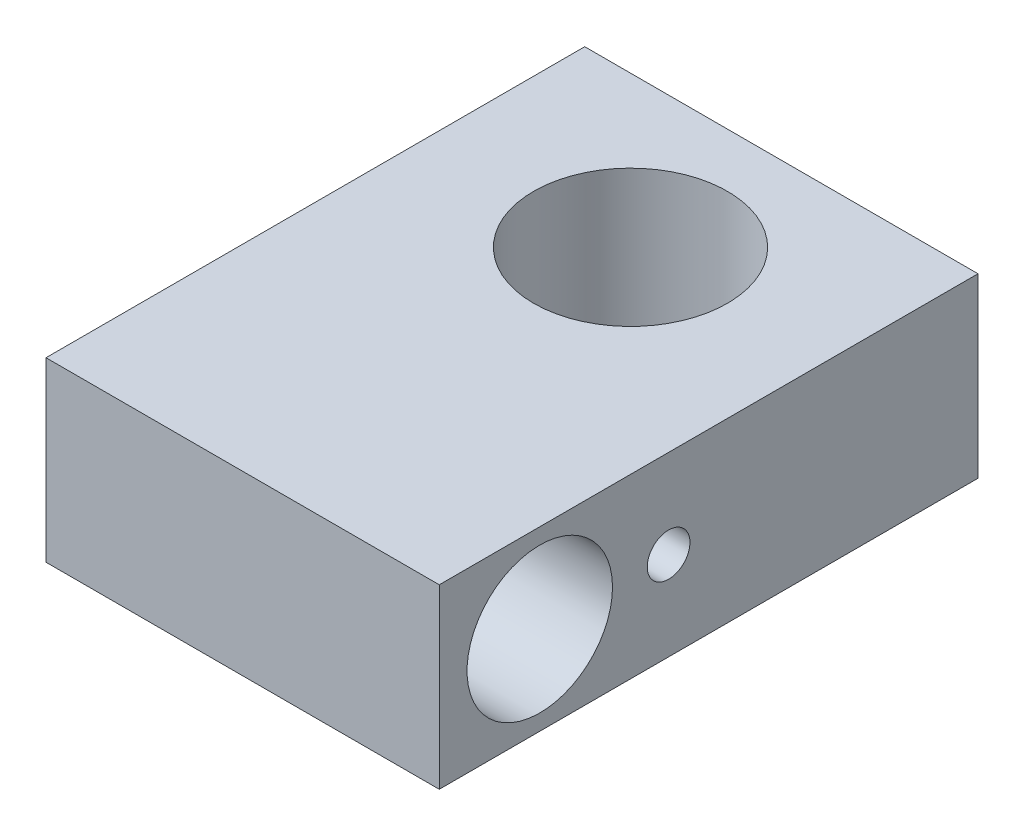
ISO-10303-21;
HEADER;
FILE_DESCRIPTION(('STEP AP214'),'2;1');
FILE_NAME('part.step','',(''),(''),'','','');
FILE_SCHEMA(('AUTOMOTIVE_DESIGN { 1 0 10303 214 1 1 1 1 }'));
ENDSEC;
DATA;
#1=APPLICATION_CONTEXT('core data for automotive mechanical design processes');
#2=APPLICATION_PROTOCOL_DEFINITION('international standard','automotive_design',2000,#1);
#3=PRODUCT_CONTEXT('',#1,'mechanical');
#4=PRODUCT('Part','Part','',(#3));
#5=PRODUCT_RELATED_PRODUCT_CATEGORY('part','',(#4));
#6=PRODUCT_DEFINITION_FORMATION('','',#4);
#7=PRODUCT_DEFINITION_CONTEXT('part definition',#1,'design');
#8=PRODUCT_DEFINITION('design','',#6,#7);
#9=PRODUCT_DEFINITION_SHAPE('','',#8);
#10=(LENGTH_UNIT() NAMED_UNIT(*) SI_UNIT(.MILLI.,.METRE.));
#11=(NAMED_UNIT(*) PLANE_ANGLE_UNIT() SI_UNIT($,.RADIAN.));
#12=(NAMED_UNIT(*) SI_UNIT($,.STERADIAN.) SOLID_ANGLE_UNIT());
#13=UNCERTAINTY_MEASURE_WITH_UNIT(LENGTH_MEASURE(1.E-05),#10,'distance_accuracy_value','');
#14=(GEOMETRIC_REPRESENTATION_CONTEXT(3) GLOBAL_UNCERTAINTY_ASSIGNED_CONTEXT((#13)) GLOBAL_UNIT_ASSIGNED_CONTEXT((#10,
#11,#12)) REPRESENTATION_CONTEXT('',''));
#15=CARTESIAN_POINT('',(0.,0.,0.));
#16=DIRECTION('',(0.,0.,1.));
#17=DIRECTION('',(1.,0.,0.));
#18=AXIS2_PLACEMENT_3D('',#15,#16,#17);
#19=CARTESIAN_POINT('',(-9.125,8.22,-7.));
#20=DIRECTION('',(0.,0.,1.));
#21=DIRECTION('',(1.,0.,0.));
#22=AXIS2_PLACEMENT_3D('',#19,#20,#21);
#23=PLANE('',#22);
#24=DIRECTION('',(-1.,0.,0.));
#25=VECTOR('',#24,1.);
#26=CARTESIAN_POINT('',(-9.125,0.,-7.));
#27=LINE('',#26,#25);
#28=CARTESIAN_POINT('',(9.125,0.,-6.99999999999999));
#29=VERTEX_POINT('',#28);
#30=CARTESIAN_POINT('',(-9.125,0.,-7.));
#31=VERTEX_POINT('',#30);
#32=EDGE_CURVE('E98',#29,#31,#27,.T.);
#33=ORIENTED_EDGE('',*,*,#32,.T.);
#34=DIRECTION('',(0.,-1.,0.));
#35=VECTOR('',#34,1.);
#36=CARTESIAN_POINT('',(-9.125,8.22,-7.));
#37=LINE('',#36,#35);
#38=CARTESIAN_POINT('',(-9.125,8.22,-7.));
#39=VERTEX_POINT('',#38);
#40=EDGE_CURVE('E11',#39,#31,#37,.T.);
#41=ORIENTED_EDGE('',*,*,#40,.F.);
#42=DIRECTION('',(-1.,0.,0.));
#43=VECTOR('',#42,1.);
#44=CARTESIAN_POINT('',(-9.125,8.22,-7.));
#45=LINE('',#44,#43);
#46=CARTESIAN_POINT('',(9.125,8.22,-6.99999999999999));
#47=VERTEX_POINT('',#46);
#48=EDGE_CURVE('E86',#47,#39,#45,.T.);
#49=ORIENTED_EDGE('',*,*,#48,.F.);
#50=DIRECTION('',(0.,-1.,0.));
#51=VECTOR('',#50,1.);
#52=CARTESIAN_POINT('',(9.125,8.22,-6.99999999999999));
#53=LINE('',#52,#51);
#54=EDGE_CURVE('E94',#47,#29,#53,.T.);
#55=ORIENTED_EDGE('',*,*,#54,.T.);
#56=EDGE_LOOP('',(#33,#41,#49,#55));
#57=FACE_BOUND('',#56,.T.);
#58=ADVANCED_FACE('F35',(#57),#23,.F.);
#59=CARTESIAN_POINT('',(-9.125,8.22,18.));
#60=DIRECTION('',(1.,0.,0.));
#61=DIRECTION('',(0.,0.,-1.));
#62=AXIS2_PLACEMENT_3D('',#59,#60,#61);
#63=PLANE('',#62);
#64=CARTESIAN_POINT('',(-9.125,4.11,7.3575));
#65=DIRECTION('',(1.,0.,0.));
#66=DIRECTION('',(0.,0.,-1.));
#67=AXIS2_PLACEMENT_3D('',#64,#65,#66);
#68=CIRCLE('',#67,0.990599999999999);
#69=CARTESIAN_POINT('',(-9.125,4.11,6.3669));
#70=VERTEX_POINT('',#69);
#71=EDGE_CURVE('E121',#70,#70,#68,.T.);
#72=ORIENTED_EDGE('',*,*,#71,.T.);
#73=EDGE_LOOP('',(#72));
#74=FACE_BOUND('',#73,.T.);
#75=CARTESIAN_POINT('',(-9.125,4.11,13.336186812336));
#76=DIRECTION('',(1.,0.,0.));
#77=DIRECTION('',(0.,0.,-1.));
#78=AXIS2_PLACEMENT_3D('',#75,#76,#77);
#79=CIRCLE('',#78,3.375);
#80=CARTESIAN_POINT('',(-9.125,4.11,9.96118681233597));
#81=VERTEX_POINT('',#80);
#82=EDGE_CURVE('E117',#81,#81,#79,.T.);
#83=ORIENTED_EDGE('',*,*,#82,.T.);
#84=EDGE_LOOP('',(#83));
#85=FACE_BOUND('',#84,.T.);
#86=DIRECTION('',(0.,0.,1.));
#87=VECTOR('',#86,1.);
#88=CARTESIAN_POINT('',(-9.125,0.,18.));
#89=LINE('',#88,#87);
#90=CARTESIAN_POINT('',(-9.125,0.,18.));
#91=VERTEX_POINT('',#90);
#92=EDGE_CURVE('E90',#31,#91,#89,.T.);
#93=ORIENTED_EDGE('',*,*,#92,.T.);
#94=DIRECTION('',(0.,-1.,0.));
#95=VECTOR('',#94,1.);
#96=CARTESIAN_POINT('',(-9.125,8.22,18.));
#97=LINE('',#96,#95);
#98=CARTESIAN_POINT('',(-9.125,8.22,18.));
#99=VERTEX_POINT('',#98);
#100=EDGE_CURVE('E43',#99,#91,#97,.T.);
#101=ORIENTED_EDGE('',*,*,#100,.F.);
#102=DIRECTION('',(0.,0.,1.));
#103=VECTOR('',#102,1.);
#104=CARTESIAN_POINT('',(-9.125,8.22,18.));
#105=LINE('',#104,#103);
#106=EDGE_CURVE('E81',#39,#99,#105,.T.);
#107=ORIENTED_EDGE('',*,*,#106,.F.);
#108=ORIENTED_EDGE('',*,*,#40,.T.);
#109=EDGE_LOOP('',(#93,#101,#107,#108));
#110=FACE_BOUND('',#109,.T.);
#111=ADVANCED_FACE('F89',(#74,#85,#110),#63,.F.);
#112=CARTESIAN_POINT('',(9.125,8.22,18.));
#113=DIRECTION('',(0.,0.,-1.));
#114=DIRECTION('',(-1.,0.,0.));
#115=AXIS2_PLACEMENT_3D('',#112,#113,#114);
#116=PLANE('',#115);
#117=DIRECTION('',(1.,0.,0.));
#118=VECTOR('',#117,1.);
#119=CARTESIAN_POINT('',(9.125,0.,18.));
#120=LINE('',#119,#118);
#121=CARTESIAN_POINT('',(9.125,0.,18.));
#122=VERTEX_POINT('',#121);
#123=EDGE_CURVE('E68',#91,#122,#120,.T.);
#124=ORIENTED_EDGE('',*,*,#123,.T.);
#125=DIRECTION('',(0.,-1.,0.));
#126=VECTOR('',#125,1.);
#127=CARTESIAN_POINT('',(9.125,8.22,18.));
#128=LINE('',#127,#126);
#129=CARTESIAN_POINT('',(9.125,8.22,18.));
#130=VERTEX_POINT('',#129);
#131=EDGE_CURVE('E91',#130,#122,#128,.T.);
#132=ORIENTED_EDGE('',*,*,#131,.F.);
#133=DIRECTION('',(1.,0.,0.));
#134=VECTOR('',#133,1.);
#135=CARTESIAN_POINT('',(9.125,8.22,18.));
#136=LINE('',#135,#134);
#137=EDGE_CURVE('E84',#99,#130,#136,.T.);
#138=ORIENTED_EDGE('',*,*,#137,.F.);
#139=ORIENTED_EDGE('',*,*,#100,.T.);
#140=EDGE_LOOP('',(#124,#132,#138,#139));
#141=FACE_BOUND('',#140,.T.);
#142=ADVANCED_FACE('F92',(#141),#116,.F.);
#143=CARTESIAN_POINT('',(9.125,8.22,-6.99999999999999));
#144=DIRECTION('',(-1.,0.,0.));
#145=DIRECTION('',(0.,0.,1.));
#146=AXIS2_PLACEMENT_3D('',#143,#144,#145);
#147=PLANE('',#146);
#148=CARTESIAN_POINT('',(9.125,4.11,7.3575));
#149=DIRECTION('',(1.,0.,0.));
#150=DIRECTION('',(0.,0.,-1.));
#151=AXIS2_PLACEMENT_3D('',#148,#149,#150);
#152=CIRCLE('',#151,0.990599999999999);
#153=CARTESIAN_POINT('',(9.125,4.11,6.3669));
#154=VERTEX_POINT('',#153);
#155=EDGE_CURVE('E124',#154,#154,#152,.T.);
#156=ORIENTED_EDGE('',*,*,#155,.F.);
#157=EDGE_LOOP('',(#156));
#158=FACE_BOUND('',#157,.T.);
#159=CARTESIAN_POINT('',(9.125,4.11,13.336186812336));
#160=DIRECTION('',(1.,0.,0.));
#161=DIRECTION('',(0.,0.,-1.));
#162=AXIS2_PLACEMENT_3D('',#159,#160,#161);
#163=CIRCLE('',#162,3.375);
#164=CARTESIAN_POINT('',(9.125,4.11,9.96118681233596));
#165=VERTEX_POINT('',#164);
#166=EDGE_CURVE('E118',#165,#165,#163,.T.);
#167=ORIENTED_EDGE('',*,*,#166,.F.);
#168=EDGE_LOOP('',(#167));
#169=FACE_BOUND('',#168,.T.);
#170=DIRECTION('',(0.,0.,-1.));
#171=VECTOR('',#170,1.);
#172=CARTESIAN_POINT('',(9.125,0.,-6.99999999999999));
#173=LINE('',#172,#171);
#174=EDGE_CURVE('E74',#122,#29,#173,.T.);
#175=ORIENTED_EDGE('',*,*,#174,.T.);
#176=ORIENTED_EDGE('',*,*,#54,.F.);
#177=DIRECTION('',(0.,0.,-1.));
#178=VECTOR('',#177,1.);
#179=CARTESIAN_POINT('',(9.125,8.22,-6.99999999999999));
#180=LINE('',#179,#178);
#181=EDGE_CURVE('E51',#130,#47,#180,.T.);
#182=ORIENTED_EDGE('',*,*,#181,.F.);
#183=ORIENTED_EDGE('',*,*,#131,.T.);
#184=EDGE_LOOP('',(#175,#176,#182,#183));
#185=FACE_BOUND('',#184,.T.);
#186=ADVANCED_FACE('F106',(#158,#169,#185),#147,.F.);
#187=CARTESIAN_POINT('',(9.125,8.22,-6.99999999999999));
#188=DIRECTION('',(0.,-1.,0.));
#189=DIRECTION('',(0.,0.,-1.));
#190=AXIS2_PLACEMENT_3D('',#187,#188,#189);
#191=PLANE('',#190);
#192=CARTESIAN_POINT('',(0.,8.22,0.));
#193=DIRECTION('',(0.,1.,0.));
#194=DIRECTION('',(0.,0.,1.));
#195=AXIS2_PLACEMENT_3D('',#192,#193,#194);
#196=CIRCLE('',#195,4.5);
#197=CARTESIAN_POINT('',(0.,8.22,4.5));
#198=VERTEX_POINT('',#197);
#199=EDGE_CURVE('E114',#198,#198,#196,.T.);
#200=ORIENTED_EDGE('',*,*,#199,.F.);
#201=EDGE_LOOP('',(#200));
#202=FACE_BOUND('',#201,.T.);
#203=ORIENTED_EDGE('',*,*,#48,.T.);
#204=ORIENTED_EDGE('',*,*,#106,.T.);
#205=ORIENTED_EDGE('',*,*,#137,.T.);
#206=ORIENTED_EDGE('',*,*,#181,.T.);
#207=EDGE_LOOP('',(#203,#204,#205,#206));
#208=FACE_BOUND('',#207,.T.);
#209=ADVANCED_FACE('F82',(#202,#208),#191,.F.);
#210=CARTESIAN_POINT('',(9.125,0.,-6.99999999999999));
#211=DIRECTION('',(0.,-1.,0.));
#212=DIRECTION('',(0.,0.,-1.));
#213=AXIS2_PLACEMENT_3D('',#210,#211,#212);
#214=PLANE('',#213);
#215=CARTESIAN_POINT('',(0.,0.,0.));
#216=DIRECTION('',(0.,1.,0.));
#217=DIRECTION('',(0.,0.,1.));
#218=AXIS2_PLACEMENT_3D('',#215,#216,#217);
#219=CIRCLE('',#218,4.5);
#220=CARTESIAN_POINT('',(0.,0.,4.5));
#221=VERTEX_POINT('',#220);
#222=EDGE_CURVE('E101',#221,#221,#219,.T.);
#223=ORIENTED_EDGE('',*,*,#222,.T.);
#224=EDGE_LOOP('',(#223));
#225=FACE_BOUND('',#224,.T.);
#226=ORIENTED_EDGE('',*,*,#32,.F.);
#227=ORIENTED_EDGE('',*,*,#174,.F.);
#228=ORIENTED_EDGE('',*,*,#123,.F.);
#229=ORIENTED_EDGE('',*,*,#92,.F.);
#230=EDGE_LOOP('',(#226,#227,#228,#229));
#231=FACE_BOUND('',#230,.T.);
#232=ADVANCED_FACE('F109',(#225,#231),#214,.T.);
#233=CARTESIAN_POINT('',(0.,8.22,0.));
#234=DIRECTION('',(0.,1.,0.));
#235=DIRECTION('',(0.,0.,1.));
#236=AXIS2_PLACEMENT_3D('',#233,#234,#235);
#237=CYLINDRICAL_SURFACE('',#236,4.5);
#238=ORIENTED_EDGE('',*,*,#222,.F.);
#239=EDGE_LOOP('',(#238));
#240=FACE_BOUND('',#239,.T.);
#241=ORIENTED_EDGE('',*,*,#199,.T.);
#242=EDGE_LOOP('',(#241));
#243=FACE_BOUND('',#242,.T.);
#244=ADVANCED_FACE('F145',(#240,#243),#237,.F.);
#245=CARTESIAN_POINT('',(-9.125,4.11,13.336186812336));
#246=DIRECTION('',(1.,0.,0.));
#247=DIRECTION('',(0.,0.,-1.));
#248=AXIS2_PLACEMENT_3D('',#245,#246,#247);
#249=CYLINDRICAL_SURFACE('',#248,3.375);
#250=ORIENTED_EDGE('',*,*,#82,.F.);
#251=EDGE_LOOP('',(#250));
#252=FACE_BOUND('',#251,.T.);
#253=ORIENTED_EDGE('',*,*,#166,.T.);
#254=EDGE_LOOP('',(#253));
#255=FACE_BOUND('',#254,.T.);
#256=ADVANCED_FACE('F135',(#252,#255),#249,.F.);
#257=CARTESIAN_POINT('',(-9.125,4.11,7.3575));
#258=DIRECTION('',(1.,0.,0.));
#259=DIRECTION('',(0.,0.,-1.));
#260=AXIS2_PLACEMENT_3D('',#257,#258,#259);
#261=CYLINDRICAL_SURFACE('',#260,0.990599999999999);
#262=ORIENTED_EDGE('',*,*,#71,.F.);
#263=EDGE_LOOP('',(#262));
#264=FACE_BOUND('',#263,.T.);
#265=ORIENTED_EDGE('',*,*,#155,.T.);
#266=EDGE_LOOP('',(#265));
#267=FACE_BOUND('',#266,.T.);
#268=ADVANCED_FACE('F132',(#264,#267),#261,.F.);
#269=CLOSED_SHELL('',(#58,#111,#142,#186,#209,#232,#244,#256,#268));
#270=MANIFOLD_SOLID_BREP('B2',#269);
#271=ADVANCED_BREP_SHAPE_REPRESENTATION('',(#18,#270),#14);
#272=SHAPE_DEFINITION_REPRESENTATION(#9,#271);
ENDSEC;
END-ISO-10303-21;
